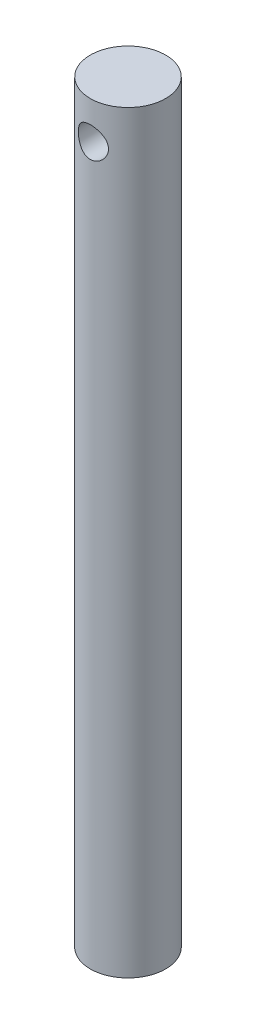
ISO-10303-21;
HEADER;
FILE_DESCRIPTION(('STEP AP214'),'2;1');
FILE_NAME('part.step','',(''),(''),'','','');
FILE_SCHEMA(('AUTOMOTIVE_DESIGN { 1 0 10303 214 1 1 1 1 }'));
ENDSEC;
DATA;
#1=APPLICATION_CONTEXT('core data for automotive mechanical design processes');
#2=APPLICATION_PROTOCOL_DEFINITION('international standard','automotive_design',2000,#1);
#3=PRODUCT_CONTEXT('',#1,'mechanical');
#4=PRODUCT('Part','Part','',(#3));
#5=PRODUCT_RELATED_PRODUCT_CATEGORY('part','',(#4));
#6=PRODUCT_DEFINITION_FORMATION('','',#4);
#7=PRODUCT_DEFINITION_CONTEXT('part definition',#1,'design');
#8=PRODUCT_DEFINITION('design','',#6,#7);
#9=PRODUCT_DEFINITION_SHAPE('','',#8);
#10=(LENGTH_UNIT() NAMED_UNIT(*) SI_UNIT(.MILLI.,.METRE.));
#11=(NAMED_UNIT(*) PLANE_ANGLE_UNIT() SI_UNIT($,.RADIAN.));
#12=(NAMED_UNIT(*) SI_UNIT($,.STERADIAN.) SOLID_ANGLE_UNIT());
#13=UNCERTAINTY_MEASURE_WITH_UNIT(LENGTH_MEASURE(1.E-05),#10,'distance_accuracy_value','');
#14=(GEOMETRIC_REPRESENTATION_CONTEXT(3) GLOBAL_UNCERTAINTY_ASSIGNED_CONTEXT((#13)) GLOBAL_UNIT_ASSIGNED_CONTEXT((#10,
#11,#12)) REPRESENTATION_CONTEXT('',''));
#15=CARTESIAN_POINT('',(0.,0.,0.));
#16=DIRECTION('',(0.,0.,1.));
#17=DIRECTION('',(1.,0.,0.));
#18=AXIS2_PLACEMENT_3D('',#15,#16,#17);
#19=CARTESIAN_POINT('',(0.,300.,0.));
#20=DIRECTION('',(0.,-1.,0.));
#21=DIRECTION('',(0.,0.,-1.));
#22=AXIS2_PLACEMENT_3D('',#19,#20,#21);
#23=CYLINDRICAL_SURFACE('',#22,15.);
#24=CARTESIAN_POINT('',(0.,300.,0.));
#25=DIRECTION('',(0.,1.,0.));
#26=DIRECTION('',(0.,0.,1.));
#27=AXIS2_PLACEMENT_3D('',#24,#25,#26);
#28=CIRCLE('',#27,15.);
#29=CARTESIAN_POINT('',(0.,300.,15.));
#30=VERTEX_POINT('',#29);
#31=EDGE_CURVE('E53',#30,#30,#28,.T.);
#32=ORIENTED_EDGE('',*,*,#31,.F.);
#33=EDGE_LOOP('',(#32));
#34=FACE_BOUND('',#33,.T.);
#35=CARTESIAN_POINT('',(0.,0.,0.));
#36=DIRECTION('',(0.,1.,0.));
#37=DIRECTION('',(0.,0.,1.));
#38=AXIS2_PLACEMENT_3D('',#35,#36,#37);
#39=CIRCLE('',#38,15.);
#40=CARTESIAN_POINT('',(0.,0.,15.));
#41=VERTEX_POINT('',#40);
#42=EDGE_CURVE('E57',#41,#41,#39,.T.);
#43=ORIENTED_EDGE('',*,*,#42,.T.);
#44=EDGE_LOOP('',(#43));
#45=FACE_BOUND('',#44,.T.);
#46=CARTESIAN_POINT('',(0.,291.,-15.));
#47=CARTESIAN_POINT('',(0.161313644504793,290.999999076337,-14.9999992799423));
#48=CARTESIAN_POINT('',(0.322689516963503,290.993485501396,-14.9973905442872));
#49=CARTESIAN_POINT('',(0.644299623195488,290.967489878212,-14.9870209396163));
#50=CARTESIAN_POINT('',(0.804533022188132,290.947999168445,-14.9792566295469));
#51=CARTESIAN_POINT('',(1.12295032515216,290.89618961968,-14.9587594719095));
#52=CARTESIAN_POINT('',(1.28112908028619,290.863843282184,-14.9460159747332));
#53=CARTESIAN_POINT('',(1.5940111010847,290.786631770146,-14.9158923525357));
#54=CARTESIAN_POINT('',(1.74871291854088,290.741761479865,-14.8985103329152));
#55=CARTESIAN_POINT('',(2.05297112205076,290.640118804639,-14.85963474988));
#56=CARTESIAN_POINT('',(2.20254446893525,290.583391195936,-14.8381566801894));
#57=CARTESIAN_POINT('',(2.49626491179012,290.458401702441,-14.7915782226374));
#58=CARTESIAN_POINT('',(2.64040995626988,290.390135509375,-14.7664764822838));
#59=CARTESIAN_POINT('',(2.92227692731373,290.242668197143,-14.7132880124765));
#60=CARTESIAN_POINT('',(3.06000372368526,290.163475555205,-14.6852036009652));
#61=CARTESIAN_POINT('',(3.32842124549353,289.994675183669,-14.6267056927006));
#62=CARTESIAN_POINT('',(3.45910939916273,289.905063684518,-14.5962913543435));
#63=CARTESIAN_POINT('',(3.85034630505218,289.613400968026,-14.4999578839521));
#64=CARTESIAN_POINT('',(4.0981207805202,289.394751503788,-14.4312855983673));
#65=CARTESIAN_POINT('',(4.55459108369284,288.919728482201,-14.2938006085538));
#66=CARTESIAN_POINT('',(4.76326779263533,288.663336577699,-14.2249878521747));
#67=CARTESIAN_POINT('',(5.04723766459796,288.248875698588,-14.1257237119284));
#68=CARTESIAN_POINT('',(5.13866506559551,288.102264897044,-14.0926348838902));
#69=CARTESIAN_POINT('',(5.30875946518036,287.801235818671,-14.0294439987206));
#70=CARTESIAN_POINT('',(5.38743171147837,287.646820787124,-13.9993407152693));
#71=CARTESIAN_POINT('',(5.53135072514936,287.331149693348,-13.9431035259271));
#72=CARTESIAN_POINT('',(5.59659658448496,287.169893169314,-13.9169698885377));
#73=CARTESIAN_POINT('',(5.7129889393006,286.841749299305,-13.8695965651366));
#74=CARTESIAN_POINT('',(5.76414249748568,286.674864821164,-13.8483544285077));
#75=CARTESIAN_POINT('',(5.84985002952934,286.344280578852,-13.812361071961));
#76=CARTESIAN_POINT('',(5.88504634552833,286.18077440622,-13.7973611781672));
#77=CARTESIAN_POINT('',(5.94169028877151,285.851047582105,-13.7730632035884));
#78=CARTESIAN_POINT('',(5.9631441251481,285.68482819137,-13.763762547854));
#79=CARTESIAN_POINT('',(5.99206783200916,285.350984079492,-13.7511953307051));
#80=CARTESIAN_POINT('',(5.99954065663821,285.183359662749,-13.7479274945764));
#81=CARTESIAN_POINT('',(6.00041818162586,284.848070900124,-13.7475446397));
#82=CARTESIAN_POINT('',(5.99382353813072,284.680406556471,-13.7504293339811));
#83=CARTESIAN_POINT('',(5.96760177471961,284.358115072259,-13.7618280557533));
#84=CARTESIAN_POINT('',(5.94891756277297,284.203395629502,-13.7699346208222));
#85=CARTESIAN_POINT('',(5.8996396544996,283.896159193445,-13.7911192754836));
#86=CARTESIAN_POINT('',(5.86904203850858,283.74364294217,-13.8041990012772));
#87=CARTESIAN_POINT('',(5.79624600676145,283.441920200982,-13.8349228158605));
#88=CARTESIAN_POINT('',(5.75405038400524,283.292712923548,-13.8525658056772));
#89=CARTESIAN_POINT('',(5.65841794933909,282.998437316038,-13.8919033105674));
#90=CARTESIAN_POINT('',(5.60497681726873,282.853370601024,-13.9135993823432));
#91=CARTESIAN_POINT('',(5.48612076549076,282.565410788033,-13.9608971317125));
#92=CARTESIAN_POINT('',(5.42048769239738,282.422619232947,-13.9865682596972));
#93=CARTESIAN_POINT('',(5.27846344073433,282.143004569633,-14.0407834641431));
#94=CARTESIAN_POINT('',(5.2020686192684,282.006183503065,-14.0693285125008));
#95=CARTESIAN_POINT('',(5.03904071569061,281.739243802499,-14.1285380661928));
#96=CARTESIAN_POINT('',(4.95240626250738,281.609126069423,-14.1592028551284));
#97=CARTESIAN_POINT('',(4.76942720642658,281.356248567233,-14.2218815851021));
#98=CARTESIAN_POINT('',(4.67308210238211,281.23348917839,-14.2538955957211));
#99=CARTESIAN_POINT('',(4.46337699329053,280.986712560819,-14.321009166178));
#100=CARTESIAN_POINT('',(4.34927691149484,280.863335983557,-14.3561554862976));
#101=CARTESIAN_POINT('',(4.11112913327325,280.62658002395,-14.4261573040414));
#102=CARTESIAN_POINT('',(3.98708438059706,280.51319770389,-14.46101288438));
#103=CARTESIAN_POINT('',(3.7296483812406,280.297023436418,-14.5295379121774));
#104=CARTESIAN_POINT('',(3.59625179230495,280.19423762648,-14.563206664882));
#105=CARTESIAN_POINT('',(3.32099627612081,280.000066112424,-14.6284304794354));
#106=CARTESIAN_POINT('',(3.17914076240928,279.908675855124,-14.6599863831411));
#107=CARTESIAN_POINT('',(2.88480363244261,279.736200293666,-14.7207656025778));
#108=CARTESIAN_POINT('',(2.73216491576378,279.655361403194,-14.7499286757954));
#109=CARTESIAN_POINT('',(2.41997061448609,279.506949752572,-14.8043518853361));
#110=CARTESIAN_POINT('',(2.26041784404165,279.439371655801,-14.8296135908351));
#111=CARTESIAN_POINT('',(1.93550182558385,279.318108247081,-14.875508159045));
#112=CARTESIAN_POINT('',(1.77013973685014,279.26442018099,-14.8961419392815));
#113=CARTESIAN_POINT('',(1.43484781894988,279.171495126827,-14.9321676804159));
#114=CARTESIAN_POINT('',(1.26491830691481,279.132257138204,-14.9475600042365));
#115=CARTESIAN_POINT('',(0.932043665210931,279.070562504686,-14.9718895403));
#116=CARTESIAN_POINT('',(0.769280790194154,279.047249745317,-14.9811550169986));
#117=CARTESIAN_POINT('',(0.442179347982634,279.014058352553,-14.9943744084218));
#118=CARTESIAN_POINT('',(0.277840858808283,279.004179057392,-14.9983285847944));
#119=CARTESIAN_POINT('',(-0.0510959013325444,278.997963353643,-15.000814515054));
#120=CARTESIAN_POINT('',(-0.215694106984602,279.001623957604,-14.9993474650838));
#121=CARTESIAN_POINT('',(-0.543895620115951,279.022440861938,-14.9910347173186));
#122=CARTESIAN_POINT('',(-0.707498946609747,279.039596903559,-14.9841891226479));
#123=CARTESIAN_POINT('',(-1.02510006060182,279.086138682258,-14.9657383242369));
#124=CARTESIAN_POINT('',(-1.17919782151467,279.114936722742,-14.9543621875242));
#125=CARTESIAN_POINT('',(-1.48434586639605,279.184399406131,-14.9271627907189));
#126=CARTESIAN_POINT('',(-1.63539513588516,279.225067931895,-14.9113380755507));
#127=CARTESIAN_POINT('',(-1.93337901855315,279.317888337839,-14.8756364442751));
#128=CARTESIAN_POINT('',(-2.08031476115195,279.370037030443,-14.8557606531008));
#129=CARTESIAN_POINT('',(-2.36928412673675,279.485409602921,-14.8124221315374));
#130=CARTESIAN_POINT('',(-2.51131586022715,279.548637695881,-14.788958037083));
#131=CARTESIAN_POINT('',(-2.79382655828657,279.687743680218,-14.738240986786));
#132=CARTESIAN_POINT('',(-2.93412902369551,279.763945987276,-14.7108949918607));
#133=CARTESIAN_POINT('',(-3.20788342050324,279.927044208683,-14.653636047145));
#134=CARTESIAN_POINT('',(-3.34133298209499,280.013943787441,-14.6237222187979));
#135=CARTESIAN_POINT('',(-3.60064969677009,280.197855331503,-14.5620427444401));
#136=CARTESIAN_POINT('',(-3.72651556540461,280.294869002277,-14.5302767865174));
#137=CARTESIAN_POINT('',(-3.97000140926487,280.498414620053,-14.4656475212144));
#138=CARTESIAN_POINT('',(-4.08762102489385,280.604946981681,-14.4327841660717));
#139=CARTESIAN_POINT('',(-4.32151965753386,280.83430170117,-14.3645492876992));
#140=CARTESIAN_POINT('',(-4.43719333742262,280.957735730363,-14.3291558684875));
#141=CARTESIAN_POINT('',(-4.6577525100815,281.213984763068,-14.2589878283471));
#142=CARTESIAN_POINT('',(-4.76264135223887,281.346796832349,-14.2242130180919));
#143=CARTESIAN_POINT('',(-4.96105804895631,281.621157237499,-14.1562321861325));
#144=CARTESIAN_POINT('',(-5.05457937701835,281.762710522344,-14.1230270722696));
#145=CARTESIAN_POINT('',(-5.22948651451797,282.05360216792,-14.0592011706988));
#146=CARTESIAN_POINT('',(-5.31087742412303,282.202937221002,-14.0285792992444));
#147=CARTESIAN_POINT('',(-5.46168285847214,282.510102600841,-13.9705625756139));
#148=CARTESIAN_POINT('',(-5.53096653567013,282.66800413063,-13.9432038872192));
#149=CARTESIAN_POINT('',(-5.65585321672463,282.98975407101,-13.8930146747533));
#150=CARTESIAN_POINT('',(-5.71146207536686,283.153599901985,-13.8701822136217));
#151=CARTESIAN_POINT('',(-5.80843082990244,283.486032936934,-13.8298551049057));
#152=CARTESIAN_POINT('',(-5.84979637281906,283.65461823312,-13.8123583422014));
#153=CARTESIAN_POINT('',(-5.91782050130812,283.995234302374,-13.7833513444251));
#154=CARTESIAN_POINT('',(-5.94448031809037,284.167264785749,-13.7718406081887));
#155=CARTESIAN_POINT('',(-5.98138158194364,284.500828938882,-13.755851283804));
#156=CARTESIAN_POINT('',(-5.99266704417584,284.662226463066,-13.7509260111925));
#157=CARTESIAN_POINT('',(-6.00216046200424,284.985476648946,-13.7467850410815));
#158=CARTESIAN_POINT('',(-6.00036897454033,285.147329290965,-13.7475691004247));
#159=CARTESIAN_POINT('',(-5.98373064604635,285.470211220904,-13.7548190919533));
#160=CARTESIAN_POINT('',(-5.96888538854158,285.631240606307,-13.7612843349661));
#161=CARTESIAN_POINT('',(-5.9263097432402,285.95126777498,-13.7796730336625));
#162=CARTESIAN_POINT('',(-5.89857941471414,286.11026556759,-13.7915964642388));
#163=CARTESIAN_POINT('',(-5.83188915830647,286.41879511351,-13.8199248571637));
#164=CARTESIAN_POINT('',(-5.79342041323658,286.568451680545,-13.8361324385079));
#165=CARTESIAN_POINT('',(-5.7052209739195,286.863930328238,-13.872733403532));
#166=CARTESIAN_POINT('',(-5.65548660991751,287.009751142093,-13.8931281509704));
#167=CARTESIAN_POINT('',(-5.54517998972387,287.296647321415,-13.9375216393973));
#168=CARTESIAN_POINT('',(-5.48460916869471,287.437723312342,-13.9615199030744));
#169=CARTESIAN_POINT('',(-5.35307990924357,287.714411727593,-14.0124768698205));
#170=CARTESIAN_POINT('',(-5.28211769758923,287.850022144397,-14.0394366473567));
#171=CARTESIAN_POINT('',(-5.04570156991897,288.26266441379,-14.1269314560258));
#172=CARTESIAN_POINT('',(-4.86295379872223,288.529185142536,-14.1914514609348));
#173=CARTESIAN_POINT('',(-4.45761854712718,289.029050840856,-14.3239291441595));
#174=CARTESIAN_POINT('',(-4.23501905872819,289.262385772853,-14.3918878541759));
#175=CARTESIAN_POINT('',(-3.86726006921136,289.590611114267,-14.4935144880377));
#176=CARTESIAN_POINT('',(-3.73448315683696,289.699266990736,-14.5283750359907));
#177=CARTESIAN_POINT('',(-3.45982226643506,289.905001305042,-14.596218858185));
#178=CARTESIAN_POINT('',(-3.31794165644069,290.002083986977,-14.6292028182708));
#179=CARTESIAN_POINT('',(-3.02578567613312,290.184040083018,-14.692412478083));
#180=CARTESIAN_POINT('',(-2.87550254240778,290.268901938131,-14.7226355566969));
#181=CARTESIAN_POINT('',(-2.56769193761233,290.425565503711,-14.7794259622235));
#182=CARTESIAN_POINT('',(-2.41016781863785,290.497373182611,-14.8059949584405));
#183=CARTESIAN_POINT('',(-2.09182205260196,290.626119840416,-14.8542831233014));
#184=CARTESIAN_POINT('',(-1.93111197302126,290.683304793524,-14.8760814885912));
#185=CARTESIAN_POINT('',(-1.60493222642554,290.783882805515,-14.9147961660502));
#186=CARTESIAN_POINT('',(-1.43946483501727,290.827282342627,-14.9317147710379));
#187=CARTESIAN_POINT('',(-1.10541479414028,290.899762802611,-14.9601501413961));
#188=CARTESIAN_POINT('',(-0.936841087451791,290.928879681046,-14.9716804678664));
#189=CARTESIAN_POINT('',(-0.597618205770605,290.972609079624,-14.9890510773976));
#190=CARTESIAN_POINT('',(-0.426970701489362,290.987232581374,-14.9948956684684));
#191=CARTESIAN_POINT('',(-0.21339042268586,290.996356392973,-14.9985429447449));
#192=CARTESIAN_POINT('',(-0.170726823310687,290.99772244129,-14.9990891025036));
#193=CARTESIAN_POINT('',(-0.0853769353554068,290.999544366812,-14.9998177253259));
#194=CARTESIAN_POINT('',(-0.042690646785872,291.000000244442,-15.0000001905588));
#195=CARTESIAN_POINT('',(0.,291.,-15.));
#196=B_SPLINE_CURVE_WITH_KNOTS('',3,(#46,#47,#48,#49,#50,#51,#52,#53,#54,#55,#56,#57,#58,#59,
#60,#61,#62,#63,#64,#65,#66,#67,#68,#69,#70,#71,#72,#73,#74,#75,#76,#77,#78,#79,#80,#81,#82,#83,
#84,#85,#86,#87,#88,#89,#90,#91,#92,#93,#94,#95,#96,#97,#98,#99,#100,#101,#102,#103,#104,#105,
#106,#107,#108,#109,#110,#111,#112,#113,#114,#115,#116,#117,#118,#119,#120,#121,#122,#123,#124,
#125,#126,#127,#128,#129,#130,#131,#132,#133,#134,#135,#136,#137,#138,#139,#140,#141,#142,#143,
#144,#145,#146,#147,#148,#149,#150,#151,#152,#153,#154,#155,#156,#157,#158,#159,#160,#161,#162,
#163,#164,#165,#166,#167,#168,#169,#170,#171,#172,#173,#174,#175,#176,#177,#178,#179,#180,#181,
#182,#183,#184,#185,#186,#187,#188,#189,#190,#191,#192,#193,#194,#195),.UNSPECIFIED.,.T.,.F.,(4,
2,2,2,2,2,2,2,2,2,2,2,2,2,2,2,2,2,2,2,2,2,2,2,2,2,2,2,2,2,2,2,2,2,2,2,2,2,2,2,2,2,2,2,2,2,2,2,2,
2,2,2,2,2,2,2,2,2,2,2,2,2,2,2,2,2,2,2,2,2,2,2,2,2,4),(0.,0.483897054152813,0.968117407228013,
1.45337914245596,1.93883938645661,2.42249849868244,2.90633859994031,3.38980540538342,
3.87344767714067,4.88128652111303,5.88961691813345,6.41682474002597,6.94381510524777,
7.47084109954814,7.99760247923351,8.50070582790111,9.00358170358734,9.5063513111493,
10.0090974686365,10.4767118882455,10.9444802892416,11.4121361420903,11.879971982238,
12.3571671117481,12.8345241636784,13.3119452055687,13.7893908988145,14.3038604025315,
14.8181781750485,15.3327921850973,15.8471999136586,16.3720340444751,16.8966565279702,
17.4211749084574,17.9456569634811,18.4390821626358,18.9324830535441,19.4257750866617,
19.9190576619765,20.3900487373938,20.8611940478454,21.3322087049456,21.8034028617177,
22.2888301938794,22.7744242768986,23.2601003750447,23.7457976390535,24.263680456111,
24.7814019482706,25.299419292813,25.8172182216539,26.3403070717152,26.8631715731926,
27.3858285361306,27.9084417339339,28.3934227501985,28.8783831115163,29.3632846514299,
29.8481839608478,30.3137727734817,30.7795134694855,31.2451925291595,31.7110411034412,
32.6951560709871,33.6795680697381,34.2042554172968,34.7287497567621,35.2537369726936,
35.7784835549451,36.2937161550921,36.8087062706882,37.3223931958723,37.8356906031082,
37.9637509906823,38.0918113186414),.UNSPECIFIED.);
#197=CARTESIAN_POINT('',(0.,291.,-15.));
#198=VERTEX_POINT('',#197);
#199=EDGE_CURVE('E49',#198,#198,#196,.T.);
#200=ORIENTED_EDGE('',*,*,#199,.F.);
#201=EDGE_LOOP('',(#200));
#202=FACE_BOUND('',#201,.T.);
#203=CARTESIAN_POINT('',(0.,279.,15.));
#204=CARTESIAN_POINT('',(0.161313644504793,279.000000923663,14.9999992799423));
#205=CARTESIAN_POINT('',(0.322689516963503,279.006514498604,14.9973905442872));
#206=CARTESIAN_POINT('',(0.644299623195488,279.032510121787,14.9870209396163));
#207=CARTESIAN_POINT('',(0.804533022188132,279.052000831555,14.9792566295469));
#208=CARTESIAN_POINT('',(1.12295032515216,279.10381038032,14.9587594719095));
#209=CARTESIAN_POINT('',(1.28112908028618,279.136156717816,14.9460159747332));
#210=CARTESIAN_POINT('',(1.59401110108469,279.213368229854,14.9158923525357));
#211=CARTESIAN_POINT('',(1.74871291854087,279.258238520135,14.8985103329152));
#212=CARTESIAN_POINT('',(2.05297112205076,279.359881195361,14.85963474988));
#213=CARTESIAN_POINT('',(2.20254446893525,279.416608804064,14.8381566801894));
#214=CARTESIAN_POINT('',(2.49626491179012,279.541598297559,14.7915782226374));
#215=CARTESIAN_POINT('',(2.64040995626988,279.609864490625,14.7664764822838));
#216=CARTESIAN_POINT('',(2.92227692731373,279.757331802857,14.7132880124765));
#217=CARTESIAN_POINT('',(3.06000372368526,279.836524444795,14.6852036009652));
#218=CARTESIAN_POINT('',(3.32842124549353,280.005324816331,14.6267056927006));
#219=CARTESIAN_POINT('',(3.45910939916273,280.094936315482,14.5962913543435));
#220=CARTESIAN_POINT('',(3.85034630505218,280.386599031974,14.4999578839521));
#221=CARTESIAN_POINT('',(4.0981207805202,280.605248496212,14.4312855983673));
#222=CARTESIAN_POINT('',(4.55459108369284,281.080271517799,14.2938006085538));
#223=CARTESIAN_POINT('',(4.76326779263533,281.336663422301,14.2249878521747));
#224=CARTESIAN_POINT('',(5.04723766459796,281.751124301412,14.1257237119284));
#225=CARTESIAN_POINT('',(5.13866506559551,281.897735102956,14.0926348838902));
#226=CARTESIAN_POINT('',(5.30875946518036,282.198764181329,14.0294439987206));
#227=CARTESIAN_POINT('',(5.38743171147837,282.353179212876,13.9993407152693));
#228=CARTESIAN_POINT('',(5.53135072514938,282.668850306652,13.9431035259271));
#229=CARTESIAN_POINT('',(5.59659658448501,282.830106830686,13.9169698885377));
#230=CARTESIAN_POINT('',(5.71298893930064,283.158250700695,13.8695965651366));
#231=CARTESIAN_POINT('',(5.7641424974857,283.325135178836,13.8483544285077));
#232=CARTESIAN_POINT('',(5.84985002952935,283.655719421148,13.812361071961));
#233=CARTESIAN_POINT('',(5.88504634552833,283.81922559378,13.7973611781672));
#234=CARTESIAN_POINT('',(5.94169028877152,284.148952417895,13.7730632035884));
#235=CARTESIAN_POINT('',(5.96314412514811,284.31517180863,13.763762547854));
#236=CARTESIAN_POINT('',(5.99206783200916,284.649015920507,13.7511953307051));
#237=CARTESIAN_POINT('',(5.99954065663821,284.816640337251,13.7479274945764));
#238=CARTESIAN_POINT('',(6.00041818162586,285.151929099875,13.7475446397));
#239=CARTESIAN_POINT('',(5.99382353813072,285.319593443528,13.7504293339811));
#240=CARTESIAN_POINT('',(5.96760177471961,285.641884927741,13.7618280557533));
#241=CARTESIAN_POINT('',(5.94891756277297,285.796604370498,13.7699346208222));
#242=CARTESIAN_POINT('',(5.8996396544996,286.103840806555,13.7911192754836));
#243=CARTESIAN_POINT('',(5.86904203850858,286.25635705783,13.8041990012772));
#244=CARTESIAN_POINT('',(5.79624600676145,286.558079799018,13.8349228158605));
#245=CARTESIAN_POINT('',(5.75405038400524,286.707287076452,13.8525658056772));
#246=CARTESIAN_POINT('',(5.65841794933908,287.001562683962,13.8919033105674));
#247=CARTESIAN_POINT('',(5.60497681726873,287.146629398976,13.9135993823432));
#248=CARTESIAN_POINT('',(5.48612076549077,287.434589211967,13.9608971317125));
#249=CARTESIAN_POINT('',(5.42048769239739,287.577380767053,13.9865682596972));
#250=CARTESIAN_POINT('',(5.27846344073434,287.856995430367,14.0407834641431));
#251=CARTESIAN_POINT('',(5.20206861926842,287.993816496935,14.0693285125008));
#252=CARTESIAN_POINT('',(5.03904071569061,288.260756197501,14.1285380661928));
#253=CARTESIAN_POINT('',(4.95240626250736,288.390873930577,14.1592028551284));
#254=CARTESIAN_POINT('',(4.76942720642656,288.643751432767,14.2218815851021));
#255=CARTESIAN_POINT('',(4.67308210238211,288.76651082161,14.2538955957211));
#256=CARTESIAN_POINT('',(4.46337699329054,289.013287439181,14.321009166178));
#257=CARTESIAN_POINT('',(4.34927691149483,289.136664016443,14.3561554862976));
#258=CARTESIAN_POINT('',(4.11112913327325,289.37341997605,14.4261573040414));
#259=CARTESIAN_POINT('',(3.98708438059708,289.48680229611,14.46101288438));
#260=CARTESIAN_POINT('',(3.72964838124063,289.702976563582,14.5295379121774));
#261=CARTESIAN_POINT('',(3.59625179230497,289.80576237352,14.563206664882));
#262=CARTESIAN_POINT('',(3.32099627612082,289.999933887575,14.6284304794354));
#263=CARTESIAN_POINT('',(3.17914076240928,290.091324144876,14.6599863831411));
#264=CARTESIAN_POINT('',(2.88480363244261,290.263799706334,14.7207656025778));
#265=CARTESIAN_POINT('',(2.73216491576378,290.344638596806,14.7499286757954));
#266=CARTESIAN_POINT('',(2.41997061448609,290.493050247428,14.8043518853361));
#267=CARTESIAN_POINT('',(2.26041784404165,290.560628344199,14.8296135908351));
#268=CARTESIAN_POINT('',(1.93550182558385,290.681891752919,14.875508159045));
#269=CARTESIAN_POINT('',(1.77013973685014,290.735579819009,14.8961419392815));
#270=CARTESIAN_POINT('',(1.43484781894988,290.828504873173,14.9321676804159));
#271=CARTESIAN_POINT('',(1.26491830691481,290.867742861796,14.9475600042365));
#272=CARTESIAN_POINT('',(0.932043665210932,290.929437495314,14.9718895403));
#273=CARTESIAN_POINT('',(0.769280790194155,290.952750254683,14.9811550169986));
#274=CARTESIAN_POINT('',(0.442179347982635,290.985941647447,14.9943744084218));
#275=CARTESIAN_POINT('',(0.277840858808284,290.995820942608,14.9983285847944));
#276=CARTESIAN_POINT('',(-0.0510959013325433,291.002036646357,15.000814515054));
#277=CARTESIAN_POINT('',(-0.2156941069846,290.998376042396,14.9993474650838));
#278=CARTESIAN_POINT('',(-0.543895620115949,290.977559138062,14.9910347173186));
#279=CARTESIAN_POINT('',(-0.707498946609746,290.960403096441,14.9841891226479));
#280=CARTESIAN_POINT('',(-1.02510006060182,290.913861317742,14.9657383242369));
#281=CARTESIAN_POINT('',(-1.17919782151467,290.885063277258,14.9543621875242));
#282=CARTESIAN_POINT('',(-1.48434586639605,290.815600593869,14.9271627907189));
#283=CARTESIAN_POINT('',(-1.63539513588516,290.774932068105,14.9113380755507));
#284=CARTESIAN_POINT('',(-1.93337901855315,290.682111662161,14.8756364442751));
#285=CARTESIAN_POINT('',(-2.08031476115195,290.629962969557,14.8557606531008));
#286=CARTESIAN_POINT('',(-2.36928412673675,290.514590397079,14.8124221315374));
#287=CARTESIAN_POINT('',(-2.51131586022715,290.451362304119,14.788958037083));
#288=CARTESIAN_POINT('',(-2.79382655828657,290.312256319782,14.738240986786));
#289=CARTESIAN_POINT('',(-2.93412902369551,290.236054012724,14.7108949918607));
#290=CARTESIAN_POINT('',(-3.20788342050324,290.072955791317,14.653636047145));
#291=CARTESIAN_POINT('',(-3.34133298209499,289.986056212559,14.6237222187979));
#292=CARTESIAN_POINT('',(-3.60064969677009,289.802144668497,14.5620427444401));
#293=CARTESIAN_POINT('',(-3.72651556540461,289.705130997723,14.5302767865174));
#294=CARTESIAN_POINT('',(-3.97000140926486,289.501585379947,14.4656475212144));
#295=CARTESIAN_POINT('',(-4.08762102489385,289.395053018319,14.4327841660717));
#296=CARTESIAN_POINT('',(-4.32151965753386,289.16569829883,14.3645492876992));
#297=CARTESIAN_POINT('',(-4.43719333742262,289.042264269637,14.3291558684875));
#298=CARTESIAN_POINT('',(-4.6577525100815,288.786015236932,14.2589878283471));
#299=CARTESIAN_POINT('',(-4.76264135223887,288.653203167651,14.2242130180919));
#300=CARTESIAN_POINT('',(-4.96105804895631,288.378842762501,14.1562321861325));
#301=CARTESIAN_POINT('',(-5.05457937701835,288.237289477656,14.1230270722696));
#302=CARTESIAN_POINT('',(-5.22948651451797,287.94639783208,14.0592011706988));
#303=CARTESIAN_POINT('',(-5.31087742412303,287.797062778998,14.0285792992444));
#304=CARTESIAN_POINT('',(-5.46168285847213,287.489897399159,13.9705625756139));
#305=CARTESIAN_POINT('',(-5.53096653567011,287.33199586937,13.9432038872192));
#306=CARTESIAN_POINT('',(-5.65585321672462,287.01024592899,13.8930146747533));
#307=CARTESIAN_POINT('',(-5.71146207536684,286.846400098015,13.8701822136217));
#308=CARTESIAN_POINT('',(-5.80843082990243,286.513967063066,13.8298551049057));
#309=CARTESIAN_POINT('',(-5.84979637281905,286.34538176688,13.8123583422014));
#310=CARTESIAN_POINT('',(-5.91782050130812,286.004765697626,13.7833513444251));
#311=CARTESIAN_POINT('',(-5.94448031809037,285.832735214251,13.7718406081887));
#312=CARTESIAN_POINT('',(-5.98138158194364,285.499171061118,13.755851283804));
#313=CARTESIAN_POINT('',(-5.99266704417584,285.337773536934,13.7509260111925));
#314=CARTESIAN_POINT('',(-6.00216046200424,285.014523351054,13.7467850410815));
#315=CARTESIAN_POINT('',(-6.00036897454033,284.852670709035,13.7475691004247));
#316=CARTESIAN_POINT('',(-5.98373064604635,284.529788779096,13.7548190919533));
#317=CARTESIAN_POINT('',(-5.96888538854158,284.368759393693,13.7612843349661));
#318=CARTESIAN_POINT('',(-5.9263097432402,284.04873222502,13.7796730336625));
#319=CARTESIAN_POINT('',(-5.89857941471414,283.88973443241,13.7915964642388));
#320=CARTESIAN_POINT('',(-5.83188915830647,283.58120488649,13.8199248571637));
#321=CARTESIAN_POINT('',(-5.79342041323658,283.431548319455,13.8361324385079));
#322=CARTESIAN_POINT('',(-5.70522097391951,283.136069671762,13.872733403532));
#323=CARTESIAN_POINT('',(-5.65548660991752,282.990248857907,13.8931281509704));
#324=CARTESIAN_POINT('',(-5.54517998972387,282.703352678585,13.9375216393973));
#325=CARTESIAN_POINT('',(-5.48460916869471,282.562276687658,13.9615199030744));
#326=CARTESIAN_POINT('',(-5.35307990924357,282.285588272407,14.0124768698205));
#327=CARTESIAN_POINT('',(-5.28211769758923,282.149977855603,14.0394366473567));
#328=CARTESIAN_POINT('',(-5.04570156991897,281.73733558621,14.1269314560258));
#329=CARTESIAN_POINT('',(-4.86295379872223,281.470814857464,14.1914514609348));
#330=CARTESIAN_POINT('',(-4.45761854712718,280.970949159144,14.3239291441595));
#331=CARTESIAN_POINT('',(-4.23501905872819,280.737614227147,14.3918878541759));
#332=CARTESIAN_POINT('',(-3.86726006921136,280.409388885733,14.4935144880377));
#333=CARTESIAN_POINT('',(-3.73448315683695,280.300733009264,14.5283750359907));
#334=CARTESIAN_POINT('',(-3.45982226643506,280.094998694958,14.596218858185));
#335=CARTESIAN_POINT('',(-3.31794165644069,279.997916013023,14.6292028182708));
#336=CARTESIAN_POINT('',(-3.02578567613312,279.815959916982,14.692412478083));
#337=CARTESIAN_POINT('',(-2.87550254240778,279.731098061869,14.7226355566969));
#338=CARTESIAN_POINT('',(-2.56769193761233,279.574434496289,14.7794259622235));
#339=CARTESIAN_POINT('',(-2.41016781863785,279.502626817389,14.8059949584405));
#340=CARTESIAN_POINT('',(-2.09182205260197,279.373880159584,14.8542831233014));
#341=CARTESIAN_POINT('',(-1.93111197302128,279.316695206476,14.8760814885912));
#342=CARTESIAN_POINT('',(-1.60493222642557,279.216117194485,14.9147961660502));
#343=CARTESIAN_POINT('',(-1.43946483501731,279.172717657373,14.9317147710379));
#344=CARTESIAN_POINT('',(-1.10541479414031,279.100237197389,14.9601501413961));
#345=CARTESIAN_POINT('',(-0.936841087451814,279.071120318954,14.9716804678664));
#346=CARTESIAN_POINT('',(-0.597618205770613,279.027390920375,14.9890510773976));
#347=CARTESIAN_POINT('',(-0.426970701489366,279.012767418625,14.9948956684684));
#348=CARTESIAN_POINT('',(-0.21339042268586,279.003643607027,14.9985429447449));
#349=CARTESIAN_POINT('',(-0.170726823310687,279.00227755871,14.9990891025036));
#350=CARTESIAN_POINT('',(-0.0853769353554068,279.000455633187,14.9998177253259));
#351=CARTESIAN_POINT('',(-0.042690646785872,278.999999755558,15.0000001905588));
#352=CARTESIAN_POINT('',(0.,279.,15.));
#353=B_SPLINE_CURVE_WITH_KNOTS('',3,(#203,#204,#205,#206,#207,#208,#209,#210,#211,#212,#213,
#214,#215,#216,#217,#218,#219,#220,#221,#222,#223,#224,#225,#226,#227,#228,#229,#230,#231,#232,
#233,#234,#235,#236,#237,#238,#239,#240,#241,#242,#243,#244,#245,#246,#247,#248,#249,#250,#251,
#252,#253,#254,#255,#256,#257,#258,#259,#260,#261,#262,#263,#264,#265,#266,#267,#268,#269,#270,
#271,#272,#273,#274,#275,#276,#277,#278,#279,#280,#281,#282,#283,#284,#285,#286,#287,#288,#289,
#290,#291,#292,#293,#294,#295,#296,#297,#298,#299,#300,#301,#302,#303,#304,#305,#306,#307,#308,
#309,#310,#311,#312,#313,#314,#315,#316,#317,#318,#319,#320,#321,#322,#323,#324,#325,#326,#327,
#328,#329,#330,#331,#332,#333,#334,#335,#336,#337,#338,#339,#340,#341,#342,#343,#344,#345,#346,
#347,#348,#349,#350,#351,#352),.UNSPECIFIED.,.T.,.F.,(4,2,2,2,2,2,2,2,2,2,2,2,2,2,2,2,2,2,2,2,2,
2,2,2,2,2,2,2,2,2,2,2,2,2,2,2,2,2,2,2,2,2,2,2,2,2,2,2,2,2,2,2,2,2,2,2,2,2,2,2,2,2,2,2,2,2,2,2,2,
2,2,2,2,2,4),(0.,0.483897054152813,0.968117407228013,1.45337914245594,1.93883938645661,
2.42249849868244,2.90633859994031,3.38980540538342,3.87344767714067,4.88128652111303,
5.88961691813345,6.41682474002597,6.94381510524777,7.47084109954826,7.99760247923351,
8.50070582790117,9.00358170358734,9.5063513111493,10.0090974686365,10.4767118882455,
10.9444802892416,11.4121361420903,11.879971982238,12.357167111748,12.8345241636784,
13.3119452055687,13.7893908988145,14.3038604025315,14.8181781750485,15.3327921850972,
15.8471999136586,16.3720340444751,16.8966565279702,17.4211749084574,17.9456569634811,
18.4390821626358,18.9324830535441,19.4257750866617,19.9190576619765,20.3900487373938,
20.8611940478454,21.3322087049456,21.8034028617177,22.2888301938794,22.7744242768986,
23.2601003750447,23.7457976390535,24.263680456111,24.7814019482706,25.299419292813,
25.8172182216539,26.3403070717152,26.8631715731925,27.3858285361306,27.9084417339339,
28.3934227501985,28.8783831115163,29.3632846514299,29.8481839608478,30.3137727734816,
30.7795134694855,31.2451925291595,31.7110411034412,32.6951560709871,33.6795680697381,
34.2042554172968,34.7287497567621,35.2537369726936,35.7784835549451,36.2937161550921,
36.8087062706881,37.3223931958723,37.8356906031082,37.9637509906823,38.0918113186414),.UNSPECIFIED.);
#354=CARTESIAN_POINT('',(0.,279.,15.));
#355=VERTEX_POINT('',#354);
#356=EDGE_CURVE('E10',#355,#355,#353,.T.);
#357=ORIENTED_EDGE('',*,*,#356,.F.);
#358=EDGE_LOOP('',(#357));
#359=FACE_BOUND('',#358,.T.);
#360=ADVANCED_FACE('F38',(#34,#45,#202,#359),#23,.T.);
#361=CARTESIAN_POINT('',(0.,300.,0.));
#362=DIRECTION('',(0.,1.,0.));
#363=DIRECTION('',(0.,0.,1.));
#364=AXIS2_PLACEMENT_3D('',#361,#362,#363);
#365=PLANE('',#364);
#366=ORIENTED_EDGE('',*,*,#31,.T.);
#367=EDGE_LOOP('',(#366));
#368=FACE_BOUND('',#367,.T.);
#369=ADVANCED_FACE('F71',(#368),#365,.T.);
#370=CARTESIAN_POINT('',(0.,0.,0.));
#371=DIRECTION('',(0.,1.,0.));
#372=DIRECTION('',(0.,0.,1.));
#373=AXIS2_PLACEMENT_3D('',#370,#371,#372);
#374=PLANE('',#373);
#375=CARTESIAN_POINT('',(0.,0.,0.));
#376=DIRECTION('',(0.,-1.,0.));
#377=DIRECTION('',(0.,0.,-1.));
#378=AXIS2_PLACEMENT_3D('',#375,#376,#377);
#379=CIRCLE('',#378,4.);
#380=CARTESIAN_POINT('',(0.,0.,-4.));
#381=VERTEX_POINT('',#380);
#382=EDGE_CURVE('E95',#381,#381,#379,.T.);
#383=ORIENTED_EDGE('',*,*,#382,.F.);
#384=EDGE_LOOP('',(#383));
#385=FACE_BOUND('',#384,.T.);
#386=ORIENTED_EDGE('',*,*,#42,.F.);
#387=EDGE_LOOP('',(#386));
#388=FACE_BOUND('',#387,.T.);
#389=ADVANCED_FACE('F69',(#385,#388),#374,.F.);
#390=CARTESIAN_POINT('',(0.,285.,15.));
#391=DIRECTION('',(0.,0.,-1.));
#392=DIRECTION('',(-1.,0.,0.));
#393=AXIS2_PLACEMENT_3D('',#390,#391,#392);
#394=CYLINDRICAL_SURFACE('',#393,6.);
#395=ORIENTED_EDGE('',*,*,#356,.T.);
#396=EDGE_LOOP('',(#395));
#397=FACE_BOUND('',#396,.T.);
#398=ORIENTED_EDGE('',*,*,#199,.T.);
#399=EDGE_LOOP('',(#398));
#400=FACE_BOUND('',#399,.T.);
#401=ADVANCED_FACE('F63',(#397,#400),#394,.F.);
#402=CARTESIAN_POINT('',(0.,2.85,0.));
#403=DIRECTION('',(0.,-1.,0.));
#404=DIRECTION('',(0.,0.,-1.));
#405=AXIS2_PLACEMENT_3D('',#402,#403,#404);
#406=CYLINDRICAL_SURFACE('',#405,4.);
#407=CARTESIAN_POINT('',(0.,2.85,0.));
#408=DIRECTION('',(0.,-1.,0.));
#409=DIRECTION('',(0.,0.,-1.));
#410=AXIS2_PLACEMENT_3D('',#407,#408,#409);
#411=CIRCLE('',#410,4.);
#412=CARTESIAN_POINT('',(0.,2.85,-4.));
#413=VERTEX_POINT('',#412);
#414=EDGE_CURVE('E93',#413,#413,#411,.T.);
#415=ORIENTED_EDGE('',*,*,#414,.F.);
#416=EDGE_LOOP('',(#415));
#417=FACE_BOUND('',#416,.T.);
#418=ORIENTED_EDGE('',*,*,#382,.T.);
#419=EDGE_LOOP('',(#418));
#420=FACE_BOUND('',#419,.T.);
#421=ADVANCED_FACE('F68',(#417,#420),#406,.F.);
#422=CARTESIAN_POINT('',(0.,2.85,0.));
#423=DIRECTION('',(0.,-1.,0.));
#424=DIRECTION('',(0.,0.,-1.));
#425=AXIS2_PLACEMENT_3D('',#422,#423,#424);
#426=PLANE('',#425);
#427=CARTESIAN_POINT('',(0.,2.85,0.));
#428=DIRECTION('',(0.,-1.,0.));
#429=DIRECTION('',(0.,0.,-1.));
#430=AXIS2_PLACEMENT_3D('',#427,#428,#429);
#431=CIRCLE('',#430,2.25);
#432=CARTESIAN_POINT('',(0.,2.85,-2.25));
#433=VERTEX_POINT('',#432);
#434=EDGE_CURVE('E103',#433,#433,#431,.T.);
#435=ORIENTED_EDGE('',*,*,#434,.F.);
#436=EDGE_LOOP('',(#435));
#437=FACE_BOUND('',#436,.T.);
#438=ORIENTED_EDGE('',*,*,#414,.T.);
#439=EDGE_LOOP('',(#438));
#440=FACE_BOUND('',#439,.T.);
#441=ADVANCED_FACE('F114',(#437,#440),#426,.T.);
#442=CARTESIAN_POINT('',(0.,5.35,0.));
#443=DIRECTION('',(0.,-1.,0.));
#444=DIRECTION('',(0.,0.,-1.));
#445=AXIS2_PLACEMENT_3D('',#442,#443,#444);
#446=CYLINDRICAL_SURFACE('',#445,2.25);
#447=CARTESIAN_POINT('',(0.,5.35,0.));
#448=DIRECTION('',(0.,-1.,0.));
#449=DIRECTION('',(0.,0.,-1.));
#450=AXIS2_PLACEMENT_3D('',#447,#448,#449);
#451=CIRCLE('',#450,2.25);
#452=CARTESIAN_POINT('',(0.,5.35,-2.25));
#453=VERTEX_POINT('',#452);
#454=EDGE_CURVE('E100',#453,#453,#451,.T.);
#455=ORIENTED_EDGE('',*,*,#454,.F.);
#456=EDGE_LOOP('',(#455));
#457=FACE_BOUND('',#456,.T.);
#458=ORIENTED_EDGE('',*,*,#434,.T.);
#459=EDGE_LOOP('',(#458));
#460=FACE_BOUND('',#459,.T.);
#461=ADVANCED_FACE('F111',(#457,#460),#446,.F.);
#462=CARTESIAN_POINT('',(0.,5.35,0.));
#463=DIRECTION('',(0.,-1.,0.));
#464=DIRECTION('',(0.,0.,-1.));
#465=AXIS2_PLACEMENT_3D('',#462,#463,#464);
#466=PLANE('',#465);
#467=ORIENTED_EDGE('',*,*,#454,.T.);
#468=EDGE_LOOP('',(#467));
#469=FACE_BOUND('',#468,.T.);
#470=ADVANCED_FACE('F109',(#469),#466,.T.);
#471=CLOSED_SHELL('',(#360,#369,#389,#401,#421,#441,#461,#470));
#472=MANIFOLD_SOLID_BREP('B2',#471);
#473=ADVANCED_BREP_SHAPE_REPRESENTATION('',(#18,#472),#14);
#474=SHAPE_DEFINITION_REPRESENTATION(#9,#473);
ENDSEC;
END-ISO-10303-21;
